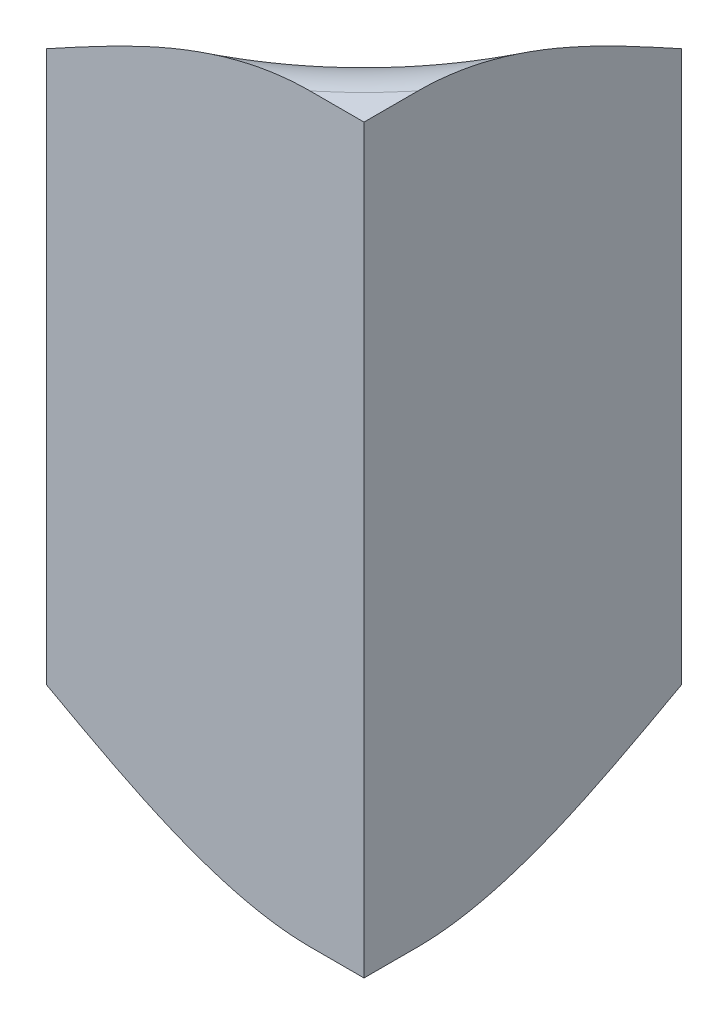
ISO-10303-21;
HEADER;
FILE_DESCRIPTION(('STEP AP214'),'2;1');
FILE_NAME('part.step','',(''),(''),'','','');
FILE_SCHEMA(('AUTOMOTIVE_DESIGN { 1 0 10303 214 1 1 1 1 }'));
ENDSEC;
DATA;
#1=APPLICATION_CONTEXT('core data for automotive mechanical design processes');
#2=APPLICATION_PROTOCOL_DEFINITION('international standard','automotive_design',2000,#1);
#3=PRODUCT_CONTEXT('',#1,'mechanical');
#4=PRODUCT('Part','Part','',(#3));
#5=PRODUCT_RELATED_PRODUCT_CATEGORY('part','',(#4));
#6=PRODUCT_DEFINITION_FORMATION('','',#4);
#7=PRODUCT_DEFINITION_CONTEXT('part definition',#1,'design');
#8=PRODUCT_DEFINITION('design','',#6,#7);
#9=PRODUCT_DEFINITION_SHAPE('','',#8);
#10=(LENGTH_UNIT() NAMED_UNIT(*) SI_UNIT(.MILLI.,.METRE.));
#11=(NAMED_UNIT(*) PLANE_ANGLE_UNIT() SI_UNIT($,.RADIAN.));
#12=(NAMED_UNIT(*) SI_UNIT($,.STERADIAN.) SOLID_ANGLE_UNIT());
#13=UNCERTAINTY_MEASURE_WITH_UNIT(LENGTH_MEASURE(1.E-05),#10,'distance_accuracy_value','');
#14=(GEOMETRIC_REPRESENTATION_CONTEXT(3) GLOBAL_UNCERTAINTY_ASSIGNED_CONTEXT((#13)) GLOBAL_UNIT_ASSIGNED_CONTEXT((#10,
#11,#12)) REPRESENTATION_CONTEXT('',''));
#15=CARTESIAN_POINT('',(0.,0.,0.));
#16=DIRECTION('',(0.,0.,1.));
#17=DIRECTION('',(1.,0.,0.));
#18=AXIS2_PLACEMENT_3D('',#15,#16,#17);
#19=CARTESIAN_POINT('',(1.7,2.46,-7.3));
#20=DIRECTION('',(0.,1.,0.));
#21=DIRECTION('',(0.,0.,1.));
#22=AXIS2_PLACEMENT_3D('',#19,#20,#21);
#23=TOROIDAL_SURFACE('',#22,0.389999999999999,0.0899999999999996);
#24=CARTESIAN_POINT('',(1.7,2.46,-7.3));
#25=DIRECTION('',(0.,1.,0.));
#26=DIRECTION('',(0.,0.,1.));
#27=AXIS2_PLACEMENT_3D('',#24,#25,#26);
#28=CIRCLE('',#27,0.299999999999999);
#29=CARTESIAN_POINT('',(1.7,2.46,-7.));
#30=VERTEX_POINT('',#29);
#31=CARTESIAN_POINT('',(2.,2.46,-7.30000000000001));
#32=VERTEX_POINT('',#31);
#33=EDGE_CURVE('E73',#30,#32,#28,.T.);
#34=ORIENTED_EDGE('',*,*,#33,.F.);
#35=CARTESIAN_POINT('',(1.94919871588861,2.55,-7.));
#36=CARTESIAN_POINT('',(1.93460949679643,2.54996873881583,-7.));
#37=CARTESIAN_POINT('',(1.92012852606943,2.54856309488377,-7.));
#38=CARTESIAN_POINT('',(1.89170783023356,2.54368423695864,-7.));
#39=CARTESIAN_POINT('',(1.87776341142426,2.54023956259986,-7.));
#40=CARTESIAN_POINT('',(1.83579746304957,2.52752219042686,-7.));
#41=CARTESIAN_POINT('',(1.80852197960269,2.51594220810294,-7.));
#42=CARTESIAN_POINT('',(1.75516434547715,2.49015615109012,-7.));
#43=CARTESIAN_POINT('',(1.72909196209087,2.47593214013208,-7.));
#44=CARTESIAN_POINT('',(1.70202548981968,2.46110939531163,-7.));
#45=CARTESIAN_POINT('',(1.70101275081159,2.46055469450969,-7.));
#46=CARTESIAN_POINT('',(1.7,2.46,-7.));
#47=B_SPLINE_CURVE_WITH_KNOTS('',3,(#35,#36,#37,#38,#39,#40,#41,#42,#43,#44,#45,#46),
.UNSPECIFIED.,.F.,.F.,(4,2,2,2,2,4),(0.,0.0435527295939451,0.0865098187320559,0.175000963365784,
0.264115894109955,0.267579995726728),.UNSPECIFIED.);
#48=CARTESIAN_POINT('',(1.94919871588808,2.55,-7.));
#49=VERTEX_POINT('',#48);
#50=EDGE_CURVE('E68',#49,#30,#47,.T.);
#51=ORIENTED_EDGE('',*,*,#50,.F.);
#52=CARTESIAN_POINT('',(1.7,2.55,-7.3));
#53=DIRECTION('',(0.,1.,0.));
#54=DIRECTION('',(0.,0.,1.));
#55=AXIS2_PLACEMENT_3D('',#52,#53,#54);
#56=CIRCLE('',#55,0.39);
#57=CARTESIAN_POINT('',(2.,2.55,-7.05080128411123));
#58=VERTEX_POINT('',#57);
#59=EDGE_CURVE('E21',#58,#49,#56,.F.);
#60=ORIENTED_EDGE('',*,*,#59,.F.);
#61=CARTESIAN_POINT('',(2.,2.46,-7.3));
#62=CARTESIAN_POINT('',(2.,2.46055469331148,-7.29898725661567));
#63=CARTESIAN_POINT('',(2.,2.46110939416545,-7.29797451732508));
#64=CARTESIAN_POINT('',(2.,2.47615989168922,-7.27049202919036));
#65=CARTESIAN_POINT('',(2.,2.4906109804786,-7.24399834794976));
#66=CARTESIAN_POINT('',(2.,2.51675946724641,-7.18967717491185));
#67=CARTESIAN_POINT('',(2.,2.52846806008304,-7.16185568411171));
#68=CARTESIAN_POINT('',(2.,2.54263860606332,-7.11373742133375));
#69=CARTESIAN_POINT('',(2.,2.54688228554533,-7.09402727811976));
#70=CARTESIAN_POINT('',(2.,2.54981614838479,-7.06402445895706));
#71=CARTESIAN_POINT('',(2.,2.55021635400833,-7.05390597518057));
#72=CARTESIAN_POINT('',(2.,2.54955798089519,-7.03370986034957));
#73=CARTESIAN_POINT('',(2.,2.54850159887963,-7.02363219071497));
#74=CARTESIAN_POINT('',(2.,2.54519918623928,-7.00684979518931));
#75=CARTESIAN_POINT('',(2.,2.5434150242651,-7.00005494157833));
#76=CARTESIAN_POINT('',(2.,2.53886646101217,-6.98679600381805));
#77=CARTESIAN_POINT('',(2.,2.53610297225817,-6.98033161813733));
#78=CARTESIAN_POINT('',(2.,2.53012138519626,-6.96914567585052));
#79=CARTESIAN_POINT('',(2.,2.5270883155809,-6.96432582286343));
#80=CARTESIAN_POINT('',(2.,2.52028079794345,-6.95523875596398));
#81=CARTESIAN_POINT('',(2.,2.51650729299449,-6.95097085040486));
#82=CARTESIAN_POINT('',(2.,2.50903441492668,-6.9439525937666));
#83=CARTESIAN_POINT('',(2.,2.5054611748476,-6.94106831875639));
#84=CARTESIAN_POINT('',(2.,2.49788615695023,-6.93592638908622));
#85=CARTESIAN_POINT('',(2.,2.49388456239999,-6.93366846791902));
#86=CARTESIAN_POINT('',(2.,2.4855116190311,-6.92989142890799));
#87=CARTESIAN_POINT('',(2.,2.48113803302174,-6.92837721558701));
#88=CARTESIAN_POINT('',(2.,2.4721811284973,-6.92621203743498));
#89=CARTESIAN_POINT('',(2.,2.46759791181045,-6.92556065799353));
#90=CARTESIAN_POINT('',(2.,2.45891376678061,-6.92518958858274));
#91=CARTESIAN_POINT('',(2.,2.45481671703714,-6.92537314245993));
#92=CARTESIAN_POINT('',(2.,2.44671856100797,-6.9264439157805));
#93=CARTESIAN_POINT('',(2.,2.44271739541587,-6.92733068805596));
#94=CARTESIAN_POINT('',(2.,2.43501262320045,-6.92972859349771));
#95=CARTESIAN_POINT('',(2.,2.43130422631036,-6.93122452010425));
#96=CARTESIAN_POINT('',(2.,2.42415641295072,-6.93476988704398));
#97=CARTESIAN_POINT('',(2.,2.4207174720548,-6.93682027880269));
#98=CARTESIAN_POINT('',(2.,2.4138664688397,-6.9416012742358));
#99=CARTESIAN_POINT('',(2.,2.41048640398364,-6.9443772931541));
#100=CARTESIAN_POINT('',(2.,2.4041646567645,-6.95036767495299));
#101=CARTESIAN_POINT('',(2.,2.40122122144443,-6.9535801800208));
#102=CARTESIAN_POINT('',(2.,2.39850407393579,-6.95696253280321));
#103=B_SPLINE_CURVE_WITH_KNOTS('',3,(#61,#62,#63,#64,#65,#66,#67,#68,#69,#70,#71,#72,#73,#74,
#75,#76,#77,#78,#79,#80,#81,#82,#83,#84,#85,#86,#87,#88,#89,#90,#91,#92,#93,#94,#95,#96,#97,#98,
#99,#100,#101,#102),.UNSPECIFIED.,.F.,.F.,(4,2,2,2,2,2,2,2,2,2,2,2,2,2,2,2,2,2,2,2,4),(0.,
0.00346410161608671,0.0940013231417254,0.184162267738124,0.244240211028092,0.274541767257823,
0.304797674800978,0.32581306373565,0.346808922053296,0.363831063314065,0.380831663025099,
0.394552608315522,0.408267706495749,0.422072076080092,0.435869809956162,0.448112045059991,
0.460346501713519,0.472292633881968,0.484259396344637,0.497334648987097,0.510355897946318),.UNSPECIFIED.);
#104=EDGE_CURVE('E65',#32,#58,#103,.T.);
#105=ORIENTED_EDGE('',*,*,#104,.F.);
#106=EDGE_LOOP('',(#34,#51,#60,#105));
#107=FACE_BOUND('',#106,.T.);
#108=ADVANCED_FACE('F17',(#107),#23,.T.);
#109=CARTESIAN_POINT('',(1.7,1.94,-7.3));
#110=DIRECTION('',(0.,1.,0.));
#111=DIRECTION('',(-1.,0.,0.));
#112=AXIS2_PLACEMENT_3D('',#109,#110,#111);
#113=CYLINDRICAL_SURFACE('',#112,0.299999999999999);
#114=DIRECTION('',(0.,-1.,0.));
#115=VECTOR('',#114,1.);
#116=CARTESIAN_POINT('',(1.7,2.20000000000024,-7.));
#117=LINE('',#116,#115);
#118=CARTESIAN_POINT('',(1.7,1.94,-7.));
#119=VERTEX_POINT('',#118);
#120=EDGE_CURVE('E84',#30,#119,#117,.T.);
#121=ORIENTED_EDGE('',*,*,#120,.F.);
#122=ORIENTED_EDGE('',*,*,#33,.T.);
#123=DIRECTION('',(0.,1.,0.));
#124=VECTOR('',#123,1.);
#125=CARTESIAN_POINT('',(2.,2.19999999999976,-7.3));
#126=LINE('',#125,#124);
#127=CARTESIAN_POINT('',(2.,1.94,-7.3));
#128=VERTEX_POINT('',#127);
#129=EDGE_CURVE('E82',#128,#32,#126,.T.);
#130=ORIENTED_EDGE('',*,*,#129,.F.);
#131=CARTESIAN_POINT('',(1.7,1.94,-7.3));
#132=DIRECTION('',(0.,1.,0.));
#133=DIRECTION('',(0.,0.,1.));
#134=AXIS2_PLACEMENT_3D('',#131,#132,#133);
#135=CIRCLE('',#134,0.299999999999999);
#136=EDGE_CURVE('E72',#119,#128,#135,.T.);
#137=ORIENTED_EDGE('',*,*,#136,.F.);
#138=EDGE_LOOP('',(#121,#122,#130,#137));
#139=FACE_BOUND('',#138,.T.);
#140=ADVANCED_FACE('F104',(#139),#113,.F.);
#141=CARTESIAN_POINT('',(1.948198715889,2.55,-7.051801284111));
#142=DIRECTION('',(0.,1.,0.));
#143=DIRECTION('',(0.,0.,1.));
#144=AXIS2_PLACEMENT_3D('',#141,#142,#143);
#145=PLANE('',#144);
#146=DIRECTION('',(-1.,0.,0.));
#147=VECTOR('',#146,1.);
#148=CARTESIAN_POINT('',(1.85,2.55,-7.));
#149=LINE('',#148,#147);
#150=CARTESIAN_POINT('',(2.,2.55,-7.));
#151=VERTEX_POINT('',#150);
#152=EDGE_CURVE('E76',#151,#49,#149,.T.);
#153=ORIENTED_EDGE('',*,*,#152,.F.);
#154=DIRECTION('',(0.,0.,1.));
#155=VECTOR('',#154,1.);
#156=CARTESIAN_POINT('',(2.,2.55,-7.15));
#157=LINE('',#156,#155);
#158=EDGE_CURVE('E74',#58,#151,#157,.T.);
#159=ORIENTED_EDGE('',*,*,#158,.F.);
#160=ORIENTED_EDGE('',*,*,#59,.T.);
#161=EDGE_LOOP('',(#153,#159,#160));
#162=FACE_BOUND('',#161,.T.);
#163=ADVANCED_FACE('F75',(#162),#145,.T.);
#164=CARTESIAN_POINT('',(1.7,1.94,-7.3));
#165=DIRECTION('',(0.,-1.,0.));
#166=DIRECTION('',(0.,0.,-1.));
#167=AXIS2_PLACEMENT_3D('',#164,#165,#166);
#168=TOROIDAL_SURFACE('',#167,0.389999999999999,0.0899999999999998);
#169=CARTESIAN_POINT('',(1.7,1.85,-7.3));
#170=DIRECTION('',(0.,-1.,0.));
#171=DIRECTION('',(0.,0.,-1.));
#172=AXIS2_PLACEMENT_3D('',#169,#170,#171);
#173=CIRCLE('',#172,0.39);
#174=CARTESIAN_POINT('',(1.94919871588827,1.85,-7.0000000000006));
#175=VERTEX_POINT('',#174);
#176=CARTESIAN_POINT('',(2.,1.85,-7.05080128411192));
#177=VERTEX_POINT('',#176);
#178=EDGE_CURVE('E121',#175,#177,#173,.F.);
#179=ORIENTED_EDGE('',*,*,#178,.F.);
#180=CARTESIAN_POINT('',(1.94919871588861,1.85,-7.));
#181=CARTESIAN_POINT('',(1.93460949679643,1.85003126118417,-7.));
#182=CARTESIAN_POINT('',(1.92012852606943,1.85143690511623,-7.));
#183=CARTESIAN_POINT('',(1.89170783023357,1.85631576304136,-7.));
#184=CARTESIAN_POINT('',(1.87776341142426,1.85976043740013,-7.));
#185=CARTESIAN_POINT('',(1.83579746304957,1.87247780957314,-7.));
#186=CARTESIAN_POINT('',(1.8085219796027,1.88405779189707,-7.));
#187=CARTESIAN_POINT('',(1.75516434547714,1.90984384890987,-7.));
#188=CARTESIAN_POINT('',(1.72909196209084,1.92406785986787,-7.));
#189=CARTESIAN_POINT('',(1.70202548981967,1.93889060468837,-7.));
#190=CARTESIAN_POINT('',(1.70101275081158,1.93944530549031,-7.));
#191=CARTESIAN_POINT('',(1.7,1.94,-7.));
#192=B_SPLINE_CURVE_WITH_KNOTS('',3,(#180,#181,#182,#183,#184,#185,#186,#187,#188,#189,#190,
#191),.UNSPECIFIED.,.F.,.F.,(4,2,2,2,2,4),(0.,0.04355272959394,0.0865098187320559,
0.175000963365787,0.264115894109955,0.267579995726728),.UNSPECIFIED.);
#193=EDGE_CURVE('E115',#119,#175,#192,.F.);
#194=ORIENTED_EDGE('',*,*,#193,.F.);
#195=ORIENTED_EDGE('',*,*,#136,.T.);
#196=CARTESIAN_POINT('',(2.,1.85,-7.05080128411138));
#197=CARTESIAN_POINT('',(2.,1.85003126118416,-7.06539050320358));
#198=CARTESIAN_POINT('',(2.,1.85143690511622,-7.07987147393059));
#199=CARTESIAN_POINT('',(2.,1.85631576304137,-7.10829216976645));
#200=CARTESIAN_POINT('',(2.,1.85976043740015,-7.12223658857575));
#201=CARTESIAN_POINT('',(2.,1.87247780957312,-7.16420253695043));
#202=CARTESIAN_POINT('',(2.,1.88405779189698,-7.19147802039734));
#203=CARTESIAN_POINT('',(2.,1.90984384890994,-7.2448356545228));
#204=CARTESIAN_POINT('',(2.,1.92406785986819,-7.27090803790897));
#205=CARTESIAN_POINT('',(2.,1.93889060468839,-7.29797451018031));
#206=CARTESIAN_POINT('',(2.,1.93944530549032,-7.29898724918841));
#207=CARTESIAN_POINT('',(2.,1.94,-7.3));
#208=B_SPLINE_CURVE_WITH_KNOTS('',3,(#196,#197,#198,#199,#200,#201,#202,#203,#204,#205,#206,
#207),.UNSPECIFIED.,.F.,.F.,(4,2,2,2,2,4),(0.,0.0435527295939736,0.0865098187320563,
0.175000963365768,0.264115894109955,0.267579995726729),.UNSPECIFIED.);
#209=EDGE_CURVE('E77',#177,#128,#208,.T.);
#210=ORIENTED_EDGE('',*,*,#209,.F.);
#211=EDGE_LOOP('',(#179,#194,#195,#210));
#212=FACE_BOUND('',#211,.T.);
#213=ADVANCED_FACE('F110',(#212),#168,.T.);
#214=CARTESIAN_POINT('',(2.,2.55100000000047,-6.999));
#215=DIRECTION('',(1.,0.,0.));
#216=DIRECTION('',(0.,-1.,0.));
#217=AXIS2_PLACEMENT_3D('',#214,#215,#216);
#218=PLANE('',#217);
#219=ORIENTED_EDGE('',*,*,#129,.T.);
#220=ORIENTED_EDGE('',*,*,#104,.T.);
#221=ORIENTED_EDGE('',*,*,#158,.T.);
#222=DIRECTION('',(0.,1.,0.));
#223=VECTOR('',#222,1.);
#224=CARTESIAN_POINT('',(2.,2.20000000000024,-7.));
#225=LINE('',#224,#223);
#226=CARTESIAN_POINT('',(2.,1.85,-7.));
#227=VERTEX_POINT('',#226);
#228=EDGE_CURVE('E36',#227,#151,#225,.T.);
#229=ORIENTED_EDGE('',*,*,#228,.F.);
#230=DIRECTION('',(0.,0.,1.));
#231=VECTOR('',#230,1.);
#232=CARTESIAN_POINT('',(2.,1.85,-7.0254006420555));
#233=LINE('',#232,#231);
#234=EDGE_CURVE('E27',#177,#227,#233,.T.);
#235=ORIENTED_EDGE('',*,*,#234,.F.);
#236=ORIENTED_EDGE('',*,*,#209,.T.);
#237=EDGE_LOOP('',(#219,#220,#221,#229,#235,#236));
#238=FACE_BOUND('',#237,.T.);
#239=ADVANCED_FACE('F79',(#238),#218,.T.);
#240=CARTESIAN_POINT('',(1.699,2.55100000000095,-7.));
#241=DIRECTION('',(0.,0.,1.));
#242=DIRECTION('',(0.,-1.,0.));
#243=AXIS2_PLACEMENT_3D('',#240,#241,#242);
#244=PLANE('',#243);
#245=ORIENTED_EDGE('',*,*,#228,.T.);
#246=ORIENTED_EDGE('',*,*,#152,.T.);
#247=ORIENTED_EDGE('',*,*,#50,.T.);
#248=ORIENTED_EDGE('',*,*,#120,.T.);
#249=ORIENTED_EDGE('',*,*,#193,.T.);
#250=DIRECTION('',(-1.,0.,0.));
#251=VECTOR('',#250,1.);
#252=CARTESIAN_POINT('',(1.9745993579445,1.85,-7.));
#253=LINE('',#252,#251);
#254=EDGE_CURVE('E11',#227,#175,#253,.T.);
#255=ORIENTED_EDGE('',*,*,#254,.F.);
#256=EDGE_LOOP('',(#245,#246,#247,#248,#249,#255));
#257=FACE_BOUND('',#256,.T.);
#258=ADVANCED_FACE('F123',(#257),#244,.T.);
#259=CARTESIAN_POINT('',(1.948198715889,1.85,-6.999));
#260=DIRECTION('',(0.,-1.,0.));
#261=DIRECTION('',(0.,0.,-1.));
#262=AXIS2_PLACEMENT_3D('',#259,#260,#261);
#263=PLANE('',#262);
#264=ORIENTED_EDGE('',*,*,#234,.T.);
#265=ORIENTED_EDGE('',*,*,#254,.T.);
#266=ORIENTED_EDGE('',*,*,#178,.T.);
#267=EDGE_LOOP('',(#264,#265,#266));
#268=FACE_BOUND('',#267,.T.);
#269=ADVANCED_FACE('F19',(#268),#263,.T.);
#270=CLOSED_SHELL('',(#108,#140,#163,#213,#239,#258,#269));
#271=MANIFOLD_SOLID_BREP('B1',#270);
#272=ADVANCED_BREP_SHAPE_REPRESENTATION('',(#18,#271),#14);
#273=SHAPE_DEFINITION_REPRESENTATION(#9,#272);
ENDSEC;
END-ISO-10303-21;
